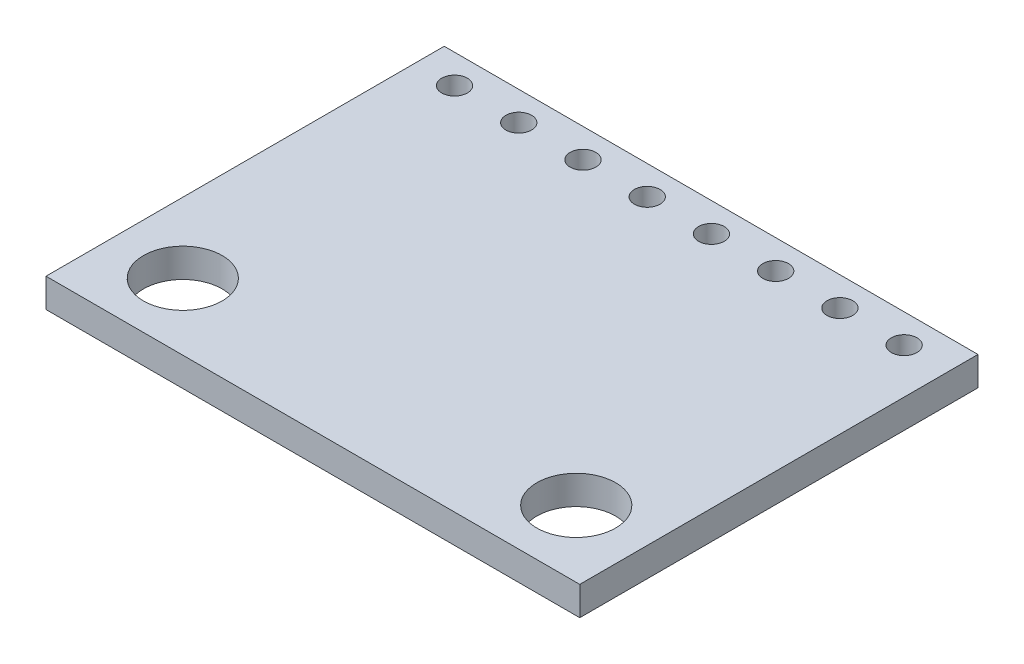
ISO-10303-21;
HEADER;
FILE_DESCRIPTION(('STEP AP214'),'2;1');
FILE_NAME('part.step','',(''),(''),'','','');
FILE_SCHEMA(('AUTOMOTIVE_DESIGN { 1 0 10303 214 1 1 1 1 }'));
ENDSEC;
DATA;
#1=APPLICATION_CONTEXT('core data for automotive mechanical design processes');
#2=APPLICATION_PROTOCOL_DEFINITION('international standard','automotive_design',2000,#1);
#3=PRODUCT_CONTEXT('',#1,'mechanical');
#4=PRODUCT('Part','Part','',(#3));
#5=PRODUCT_RELATED_PRODUCT_CATEGORY('part','',(#4));
#6=PRODUCT_DEFINITION_FORMATION('','',#4);
#7=PRODUCT_DEFINITION_CONTEXT('part definition',#1,'design');
#8=PRODUCT_DEFINITION('design','',#6,#7);
#9=PRODUCT_DEFINITION_SHAPE('','',#8);
#10=(LENGTH_UNIT() NAMED_UNIT(*) SI_UNIT(.MILLI.,.METRE.));
#11=(NAMED_UNIT(*) PLANE_ANGLE_UNIT() SI_UNIT($,.RADIAN.));
#12=(NAMED_UNIT(*) SI_UNIT($,.STERADIAN.) SOLID_ANGLE_UNIT());
#13=UNCERTAINTY_MEASURE_WITH_UNIT(LENGTH_MEASURE(1.E-05),#10,'distance_accuracy_value','');
#14=(GEOMETRIC_REPRESENTATION_CONTEXT(3) GLOBAL_UNCERTAINTY_ASSIGNED_CONTEXT((#13)) GLOBAL_UNIT_ASSIGNED_CONTEXT((#10,
#11,#12)) REPRESENTATION_CONTEXT('',''));
#15=CARTESIAN_POINT('',(0.,0.,0.));
#16=DIRECTION('',(0.,0.,1.));
#17=DIRECTION('',(1.,0.,0.));
#18=AXIS2_PLACEMENT_3D('',#15,#16,#17);
#19=CARTESIAN_POINT('',(0.,0.5715,0.));
#20=DIRECTION('',(0.,-1.,0.));
#21=DIRECTION('',(0.,0.,-1.));
#22=AXIS2_PLACEMENT_3D('',#19,#20,#21);
#23=PLANE('',#22);
#24=CARTESIAN_POINT('',(6.2357,0.5715,-6.731));
#25=DIRECTION('',(0.,1.,0.));
#26=DIRECTION('',(0.,0.,1.));
#27=AXIS2_PLACEMENT_3D('',#24,#25,#26);
#28=CIRCLE('',#27,0.508);
#29=CARTESIAN_POINT('',(6.2357,0.5715,-6.223));
#30=VERTEX_POINT('',#29);
#31=EDGE_CURVE('E159',#30,#30,#28,.T.);
#32=ORIENTED_EDGE('',*,*,#31,.F.);
#33=EDGE_LOOP('',(#32));
#34=FACE_BOUND('',#33,.T.);
#35=CARTESIAN_POINT('',(1.1557,0.5715,-6.731));
#36=DIRECTION('',(0.,1.,0.));
#37=DIRECTION('',(0.,0.,1.));
#38=AXIS2_PLACEMENT_3D('',#35,#36,#37);
#39=CIRCLE('',#38,0.508);
#40=CARTESIAN_POINT('',(1.1557,0.5715,-6.223));
#41=VERTEX_POINT('',#40);
#42=EDGE_CURVE('E147',#41,#41,#39,.T.);
#43=ORIENTED_EDGE('',*,*,#42,.F.);
#44=EDGE_LOOP('',(#43));
#45=FACE_BOUND('',#44,.T.);
#46=CARTESIAN_POINT('',(-3.9243,0.5715,-6.731));
#47=DIRECTION('',(0.,1.,0.));
#48=DIRECTION('',(0.,0.,1.));
#49=AXIS2_PLACEMENT_3D('',#46,#47,#48);
#50=CIRCLE('',#49,0.508);
#51=CARTESIAN_POINT('',(-3.9243,0.5715,-6.223));
#52=VERTEX_POINT('',#51);
#53=EDGE_CURVE('E135',#52,#52,#50,.T.);
#54=ORIENTED_EDGE('',*,*,#53,.F.);
#55=EDGE_LOOP('',(#54));
#56=FACE_BOUND('',#55,.T.);
#57=CARTESIAN_POINT('',(-9.0043,0.5715,-6.731));
#58=DIRECTION('',(0.,1.,0.));
#59=DIRECTION('',(0.,0.,1.));
#60=AXIS2_PLACEMENT_3D('',#57,#58,#59);
#61=CIRCLE('',#60,0.508);
#62=CARTESIAN_POINT('',(-9.0043,0.5715,-6.223));
#63=VERTEX_POINT('',#62);
#64=EDGE_CURVE('E123',#63,#63,#61,.T.);
#65=ORIENTED_EDGE('',*,*,#64,.F.);
#66=EDGE_LOOP('',(#65));
#67=FACE_BOUND('',#66,.T.);
#68=CARTESIAN_POINT('',(-7.77875,0.5715,5.23875));
#69=DIRECTION('',(0.,1.,0.));
#70=DIRECTION('',(0.,0.,1.));
#71=AXIS2_PLACEMENT_3D('',#68,#69,#70);
#72=CIRCLE('',#71,1.55575);
#73=CARTESIAN_POINT('',(-7.77875,0.5715,6.79449999999999));
#74=VERTEX_POINT('',#73);
#75=EDGE_CURVE('E102',#74,#74,#72,.T.);
#76=ORIENTED_EDGE('',*,*,#75,.F.);
#77=EDGE_LOOP('',(#76));
#78=FACE_BOUND('',#77,.T.);
#79=DIRECTION('',(0.,0.,-1.));
#80=VECTOR('',#79,1.);
#81=CARTESIAN_POINT('',(10.5537,0.5715,7.874));
#82=LINE('',#81,#80);
#83=CARTESIAN_POINT('',(10.5537,0.5715,7.874));
#84=VERTEX_POINT('',#83);
#85=CARTESIAN_POINT('',(10.5537,0.5715,-7.874));
#86=VERTEX_POINT('',#85);
#87=EDGE_CURVE('E87',#84,#86,#82,.T.);
#88=ORIENTED_EDGE('',*,*,#87,.T.);
#89=DIRECTION('',(-1.,0.,0.));
#90=VECTOR('',#89,1.);
#91=CARTESIAN_POINT('',(-10.5537,0.5715,-7.874));
#92=LINE('',#91,#90);
#93=CARTESIAN_POINT('',(-10.5537,0.5715,-7.874));
#94=VERTEX_POINT('',#93);
#95=EDGE_CURVE('E82',#86,#94,#92,.T.);
#96=ORIENTED_EDGE('',*,*,#95,.T.);
#97=DIRECTION('',(0.,0.,1.));
#98=VECTOR('',#97,1.);
#99=CARTESIAN_POINT('',(-10.5537,0.5715,7.874));
#100=LINE('',#99,#98);
#101=CARTESIAN_POINT('',(-10.5537,0.5715,7.874));
#102=VERTEX_POINT('',#101);
#103=EDGE_CURVE('E85',#94,#102,#100,.T.);
#104=ORIENTED_EDGE('',*,*,#103,.T.);
#105=DIRECTION('',(1.,0.,0.));
#106=VECTOR('',#105,1.);
#107=CARTESIAN_POINT('',(-10.5537,0.5715,7.874));
#108=LINE('',#107,#106);
#109=EDGE_CURVE('E52',#102,#84,#108,.T.);
#110=ORIENTED_EDGE('',*,*,#109,.T.);
#111=EDGE_LOOP('',(#88,#96,#104,#110));
#112=FACE_BOUND('',#111,.T.);
#113=CARTESIAN_POINT('',(7.77875,0.5715,5.23875));
#114=DIRECTION('',(0.,1.,0.));
#115=DIRECTION('',(0.,0.,-1.));
#116=AXIS2_PLACEMENT_3D('',#113,#114,#115);
#117=CIRCLE('',#116,1.55575);
#118=CARTESIAN_POINT('',(7.77875,0.5715,3.683));
#119=VERTEX_POINT('',#118);
#120=EDGE_CURVE('E117',#119,#119,#117,.T.);
#121=ORIENTED_EDGE('',*,*,#120,.F.);
#122=EDGE_LOOP('',(#121));
#123=FACE_BOUND('',#122,.T.);
#124=CARTESIAN_POINT('',(-6.4643,0.5715,-6.731));
#125=DIRECTION('',(0.,1.,0.));
#126=DIRECTION('',(0.,0.,1.));
#127=AXIS2_PLACEMENT_3D('',#124,#125,#126);
#128=CIRCLE('',#127,0.508);
#129=CARTESIAN_POINT('',(-6.4643,0.5715,-6.223));
#130=VERTEX_POINT('',#129);
#131=EDGE_CURVE('E129',#130,#130,#128,.T.);
#132=ORIENTED_EDGE('',*,*,#131,.F.);
#133=EDGE_LOOP('',(#132));
#134=FACE_BOUND('',#133,.T.);
#135=CARTESIAN_POINT('',(-1.3843,0.5715,-6.731));
#136=DIRECTION('',(0.,1.,0.));
#137=DIRECTION('',(0.,0.,1.));
#138=AXIS2_PLACEMENT_3D('',#135,#136,#137);
#139=CIRCLE('',#138,0.508);
#140=CARTESIAN_POINT('',(-1.3843,0.5715,-6.223));
#141=VERTEX_POINT('',#140);
#142=EDGE_CURVE('E141',#141,#141,#139,.T.);
#143=ORIENTED_EDGE('',*,*,#142,.F.);
#144=EDGE_LOOP('',(#143));
#145=FACE_BOUND('',#144,.T.);
#146=CARTESIAN_POINT('',(3.6957,0.5715,-6.731));
#147=DIRECTION('',(0.,1.,0.));
#148=DIRECTION('',(0.,0.,1.));
#149=AXIS2_PLACEMENT_3D('',#146,#147,#148);
#150=CIRCLE('',#149,0.508);
#151=CARTESIAN_POINT('',(3.6957,0.5715,-6.223));
#152=VERTEX_POINT('',#151);
#153=EDGE_CURVE('E153',#152,#152,#150,.T.);
#154=ORIENTED_EDGE('',*,*,#153,.F.);
#155=EDGE_LOOP('',(#154));
#156=FACE_BOUND('',#155,.T.);
#157=CARTESIAN_POINT('',(8.7757,0.5715,-6.731));
#158=DIRECTION('',(0.,1.,0.));
#159=DIRECTION('',(0.,0.,1.));
#160=AXIS2_PLACEMENT_3D('',#157,#158,#159);
#161=CIRCLE('',#160,0.508);
#162=CARTESIAN_POINT('',(8.7757,0.5715,-6.223));
#163=VERTEX_POINT('',#162);
#164=EDGE_CURVE('E165',#163,#163,#161,.T.);
#165=ORIENTED_EDGE('',*,*,#164,.F.);
#166=EDGE_LOOP('',(#165));
#167=FACE_BOUND('',#166,.T.);
#168=ADVANCED_FACE('F35',(#34,#45,#56,#67,#78,#112,#123,#134,#145,#156,#167),#23,.F.);
#169=CARTESIAN_POINT('',(0.,-0.5715,0.));
#170=DIRECTION('',(0.,-1.,0.));
#171=DIRECTION('',(0.,0.,-1.));
#172=AXIS2_PLACEMENT_3D('',#169,#170,#171);
#173=PLANE('',#172);
#174=CARTESIAN_POINT('',(6.2357,-0.5715,-6.731));
#175=DIRECTION('',(0.,1.,0.));
#176=DIRECTION('',(0.,0.,1.));
#177=AXIS2_PLACEMENT_3D('',#174,#175,#176);
#178=CIRCLE('',#177,0.508);
#179=CARTESIAN_POINT('',(6.2357,-0.5715,-6.223));
#180=VERTEX_POINT('',#179);
#181=EDGE_CURVE('E162',#180,#180,#178,.T.);
#182=ORIENTED_EDGE('',*,*,#181,.T.);
#183=EDGE_LOOP('',(#182));
#184=FACE_BOUND('',#183,.T.);
#185=CARTESIAN_POINT('',(1.1557,-0.5715,-6.731));
#186=DIRECTION('',(0.,1.,0.));
#187=DIRECTION('',(0.,0.,1.));
#188=AXIS2_PLACEMENT_3D('',#185,#186,#187);
#189=CIRCLE('',#188,0.508);
#190=CARTESIAN_POINT('',(1.1557,-0.5715,-6.223));
#191=VERTEX_POINT('',#190);
#192=EDGE_CURVE('E150',#191,#191,#189,.T.);
#193=ORIENTED_EDGE('',*,*,#192,.T.);
#194=EDGE_LOOP('',(#193));
#195=FACE_BOUND('',#194,.T.);
#196=CARTESIAN_POINT('',(-3.9243,-0.5715,-6.731));
#197=DIRECTION('',(0.,1.,0.));
#198=DIRECTION('',(0.,0.,1.));
#199=AXIS2_PLACEMENT_3D('',#196,#197,#198);
#200=CIRCLE('',#199,0.508);
#201=CARTESIAN_POINT('',(-3.9243,-0.5715,-6.223));
#202=VERTEX_POINT('',#201);
#203=EDGE_CURVE('E138',#202,#202,#200,.T.);
#204=ORIENTED_EDGE('',*,*,#203,.T.);
#205=EDGE_LOOP('',(#204));
#206=FACE_BOUND('',#205,.T.);
#207=CARTESIAN_POINT('',(-9.0043,-0.5715,-6.731));
#208=DIRECTION('',(0.,1.,0.));
#209=DIRECTION('',(0.,0.,1.));
#210=AXIS2_PLACEMENT_3D('',#207,#208,#209);
#211=CIRCLE('',#210,0.508);
#212=CARTESIAN_POINT('',(-9.0043,-0.5715,-6.223));
#213=VERTEX_POINT('',#212);
#214=EDGE_CURVE('E126',#213,#213,#211,.T.);
#215=ORIENTED_EDGE('',*,*,#214,.T.);
#216=EDGE_LOOP('',(#215));
#217=FACE_BOUND('',#216,.T.);
#218=CARTESIAN_POINT('',(-7.77875,-0.5715,5.23875));
#219=DIRECTION('',(0.,1.,0.));
#220=DIRECTION('',(0.,0.,1.));
#221=AXIS2_PLACEMENT_3D('',#218,#219,#220);
#222=CIRCLE('',#221,1.55575);
#223=CARTESIAN_POINT('',(-7.77875,-0.5715,6.79449999999999));
#224=VERTEX_POINT('',#223);
#225=EDGE_CURVE('E114',#224,#224,#222,.T.);
#226=ORIENTED_EDGE('',*,*,#225,.T.);
#227=EDGE_LOOP('',(#226));
#228=FACE_BOUND('',#227,.T.);
#229=DIRECTION('',(0.,0.,-1.));
#230=VECTOR('',#229,1.);
#231=CARTESIAN_POINT('',(10.5537,-0.5715,7.874));
#232=LINE('',#231,#230);
#233=CARTESIAN_POINT('',(10.5537,-0.5715,7.874));
#234=VERTEX_POINT('',#233);
#235=CARTESIAN_POINT('',(10.5537,-0.5715,-7.874));
#236=VERTEX_POINT('',#235);
#237=EDGE_CURVE('E99',#234,#236,#232,.T.);
#238=ORIENTED_EDGE('',*,*,#237,.F.);
#239=DIRECTION('',(1.,0.,0.));
#240=VECTOR('',#239,1.);
#241=CARTESIAN_POINT('',(-10.5537,-0.5715,7.874));
#242=LINE('',#241,#240);
#243=CARTESIAN_POINT('',(-10.5537,-0.5715,7.874));
#244=VERTEX_POINT('',#243);
#245=EDGE_CURVE('E75',#244,#234,#242,.T.);
#246=ORIENTED_EDGE('',*,*,#245,.F.);
#247=DIRECTION('',(0.,0.,1.));
#248=VECTOR('',#247,1.);
#249=CARTESIAN_POINT('',(-10.5537,-0.5715,7.874));
#250=LINE('',#249,#248);
#251=CARTESIAN_POINT('',(-10.5537,-0.5715,-7.874));
#252=VERTEX_POINT('',#251);
#253=EDGE_CURVE('E69',#252,#244,#250,.T.);
#254=ORIENTED_EDGE('',*,*,#253,.F.);
#255=DIRECTION('',(-1.,0.,0.));
#256=VECTOR('',#255,1.);
#257=CARTESIAN_POINT('',(-10.5537,-0.5715,-7.874));
#258=LINE('',#257,#256);
#259=EDGE_CURVE('E91',#236,#252,#258,.T.);
#260=ORIENTED_EDGE('',*,*,#259,.F.);
#261=EDGE_LOOP('',(#238,#246,#254,#260));
#262=FACE_BOUND('',#261,.T.);
#263=CARTESIAN_POINT('',(7.77875,-0.5715,5.23875));
#264=DIRECTION('',(0.,1.,0.));
#265=DIRECTION('',(0.,0.,-1.));
#266=AXIS2_PLACEMENT_3D('',#263,#264,#265);
#267=CIRCLE('',#266,1.55575);
#268=CARTESIAN_POINT('',(7.77875,-0.5715,3.683));
#269=VERTEX_POINT('',#268);
#270=EDGE_CURVE('E120',#269,#269,#267,.T.);
#271=ORIENTED_EDGE('',*,*,#270,.T.);
#272=EDGE_LOOP('',(#271));
#273=FACE_BOUND('',#272,.T.);
#274=CARTESIAN_POINT('',(-6.4643,-0.5715,-6.731));
#275=DIRECTION('',(0.,1.,0.));
#276=DIRECTION('',(0.,0.,1.));
#277=AXIS2_PLACEMENT_3D('',#274,#275,#276);
#278=CIRCLE('',#277,0.508);
#279=CARTESIAN_POINT('',(-6.4643,-0.5715,-6.223));
#280=VERTEX_POINT('',#279);
#281=EDGE_CURVE('E132',#280,#280,#278,.T.);
#282=ORIENTED_EDGE('',*,*,#281,.T.);
#283=EDGE_LOOP('',(#282));
#284=FACE_BOUND('',#283,.T.);
#285=CARTESIAN_POINT('',(-1.3843,-0.5715,-6.731));
#286=DIRECTION('',(0.,1.,0.));
#287=DIRECTION('',(0.,0.,1.));
#288=AXIS2_PLACEMENT_3D('',#285,#286,#287);
#289=CIRCLE('',#288,0.508);
#290=CARTESIAN_POINT('',(-1.3843,-0.5715,-6.223));
#291=VERTEX_POINT('',#290);
#292=EDGE_CURVE('E144',#291,#291,#289,.T.);
#293=ORIENTED_EDGE('',*,*,#292,.T.);
#294=EDGE_LOOP('',(#293));
#295=FACE_BOUND('',#294,.T.);
#296=CARTESIAN_POINT('',(3.6957,-0.5715,-6.731));
#297=DIRECTION('',(0.,1.,0.));
#298=DIRECTION('',(0.,0.,1.));
#299=AXIS2_PLACEMENT_3D('',#296,#297,#298);
#300=CIRCLE('',#299,0.508);
#301=CARTESIAN_POINT('',(3.6957,-0.5715,-6.223));
#302=VERTEX_POINT('',#301);
#303=EDGE_CURVE('E156',#302,#302,#300,.T.);
#304=ORIENTED_EDGE('',*,*,#303,.T.);
#305=EDGE_LOOP('',(#304));
#306=FACE_BOUND('',#305,.T.);
#307=CARTESIAN_POINT('',(8.7757,-0.5715,-6.731));
#308=DIRECTION('',(0.,1.,0.));
#309=DIRECTION('',(0.,0.,1.));
#310=AXIS2_PLACEMENT_3D('',#307,#308,#309);
#311=CIRCLE('',#310,0.508);
#312=CARTESIAN_POINT('',(8.7757,-0.5715,-6.223));
#313=VERTEX_POINT('',#312);
#314=EDGE_CURVE('E168',#313,#313,#311,.T.);
#315=ORIENTED_EDGE('',*,*,#314,.T.);
#316=EDGE_LOOP('',(#315));
#317=FACE_BOUND('',#316,.T.);
#318=ADVANCED_FACE('F110',(#184,#195,#206,#217,#228,#262,#273,#284,#295,#306,#317),#173,.T.);
#319=CARTESIAN_POINT('',(10.5537,0.5715,7.874));
#320=DIRECTION('',(-1.,0.,0.));
#321=DIRECTION('',(0.,0.,1.));
#322=AXIS2_PLACEMENT_3D('',#319,#320,#321);
#323=PLANE('',#322);
#324=ORIENTED_EDGE('',*,*,#237,.T.);
#325=DIRECTION('',(0.,-1.,0.));
#326=VECTOR('',#325,1.);
#327=CARTESIAN_POINT('',(10.5537,0.5715,-7.874));
#328=LINE('',#327,#326);
#329=EDGE_CURVE('E11',#86,#236,#328,.T.);
#330=ORIENTED_EDGE('',*,*,#329,.F.);
#331=ORIENTED_EDGE('',*,*,#87,.F.);
#332=DIRECTION('',(0.,-1.,0.));
#333=VECTOR('',#332,1.);
#334=CARTESIAN_POINT('',(10.5537,0.5715,7.874));
#335=LINE('',#334,#333);
#336=EDGE_CURVE('E95',#84,#234,#335,.T.);
#337=ORIENTED_EDGE('',*,*,#336,.T.);
#338=EDGE_LOOP('',(#324,#330,#331,#337));
#339=FACE_BOUND('',#338,.T.);
#340=ADVANCED_FACE('F37',(#339),#323,.F.);
#341=CARTESIAN_POINT('',(-10.5537,0.5715,-7.874));
#342=DIRECTION('',(0.,0.,1.));
#343=DIRECTION('',(1.,0.,0.));
#344=AXIS2_PLACEMENT_3D('',#341,#342,#343);
#345=PLANE('',#344);
#346=ORIENTED_EDGE('',*,*,#259,.T.);
#347=DIRECTION('',(0.,-1.,0.));
#348=VECTOR('',#347,1.);
#349=CARTESIAN_POINT('',(-10.5537,0.5715,-7.874));
#350=LINE('',#349,#348);
#351=EDGE_CURVE('E44',#94,#252,#350,.T.);
#352=ORIENTED_EDGE('',*,*,#351,.F.);
#353=ORIENTED_EDGE('',*,*,#95,.F.);
#354=ORIENTED_EDGE('',*,*,#329,.T.);
#355=EDGE_LOOP('',(#346,#352,#353,#354));
#356=FACE_BOUND('',#355,.T.);
#357=ADVANCED_FACE('F90',(#356),#345,.F.);
#358=CARTESIAN_POINT('',(-10.5537,0.5715,7.874));
#359=DIRECTION('',(1.,0.,0.));
#360=DIRECTION('',(0.,0.,-1.));
#361=AXIS2_PLACEMENT_3D('',#358,#359,#360);
#362=PLANE('',#361);
#363=ORIENTED_EDGE('',*,*,#253,.T.);
#364=DIRECTION('',(0.,-1.,0.));
#365=VECTOR('',#364,1.);
#366=CARTESIAN_POINT('',(-10.5537,0.5715,7.874));
#367=LINE('',#366,#365);
#368=EDGE_CURVE('E92',#102,#244,#367,.T.);
#369=ORIENTED_EDGE('',*,*,#368,.F.);
#370=ORIENTED_EDGE('',*,*,#103,.F.);
#371=ORIENTED_EDGE('',*,*,#351,.T.);
#372=EDGE_LOOP('',(#363,#369,#370,#371));
#373=FACE_BOUND('',#372,.T.);
#374=ADVANCED_FACE('F93',(#373),#362,.F.);
#375=CARTESIAN_POINT('',(-10.5537,0.5715,7.874));
#376=DIRECTION('',(0.,0.,-1.));
#377=DIRECTION('',(-1.,0.,0.));
#378=AXIS2_PLACEMENT_3D('',#375,#376,#377);
#379=PLANE('',#378);
#380=ORIENTED_EDGE('',*,*,#245,.T.);
#381=ORIENTED_EDGE('',*,*,#336,.F.);
#382=ORIENTED_EDGE('',*,*,#109,.F.);
#383=ORIENTED_EDGE('',*,*,#368,.T.);
#384=EDGE_LOOP('',(#380,#381,#382,#383));
#385=FACE_BOUND('',#384,.T.);
#386=ADVANCED_FACE('F107',(#385),#379,.F.);
#387=CARTESIAN_POINT('',(-7.77875,0.5715,5.23875));
#388=DIRECTION('',(0.,-1.,0.));
#389=DIRECTION('',(0.,0.,-1.));
#390=AXIS2_PLACEMENT_3D('',#387,#388,#389);
#391=CYLINDRICAL_SURFACE('',#390,1.55575);
#392=ORIENTED_EDGE('',*,*,#75,.T.);
#393=EDGE_LOOP('',(#392));
#394=FACE_BOUND('',#393,.T.);
#395=ORIENTED_EDGE('',*,*,#225,.F.);
#396=EDGE_LOOP('',(#395));
#397=FACE_BOUND('',#396,.T.);
#398=ADVANCED_FACE('F188',(#394,#397),#391,.F.);
#399=CARTESIAN_POINT('',(7.77875,0.5715,5.23875));
#400=DIRECTION('',(0.,-1.,0.));
#401=DIRECTION('',(0.,0.,-1.));
#402=AXIS2_PLACEMENT_3D('',#399,#400,#401);
#403=CYLINDRICAL_SURFACE('',#402,1.55575);
#404=ORIENTED_EDGE('',*,*,#120,.T.);
#405=EDGE_LOOP('',(#404));
#406=FACE_BOUND('',#405,.T.);
#407=ORIENTED_EDGE('',*,*,#270,.F.);
#408=EDGE_LOOP('',(#407));
#409=FACE_BOUND('',#408,.T.);
#410=ADVANCED_FACE('F212',(#406,#409),#403,.F.);
#411=CARTESIAN_POINT('',(-9.0043,0.5715,-6.731));
#412=DIRECTION('',(0.,-1.,0.));
#413=DIRECTION('',(0.,0.,-1.));
#414=AXIS2_PLACEMENT_3D('',#411,#412,#413);
#415=CYLINDRICAL_SURFACE('',#414,0.508);
#416=ORIENTED_EDGE('',*,*,#64,.T.);
#417=EDGE_LOOP('',(#416));
#418=FACE_BOUND('',#417,.T.);
#419=ORIENTED_EDGE('',*,*,#214,.F.);
#420=EDGE_LOOP('',(#419));
#421=FACE_BOUND('',#420,.T.);
#422=ADVANCED_FACE('F217',(#418,#421),#415,.F.);
#423=CARTESIAN_POINT('',(-6.4643,0.5715,-6.731));
#424=DIRECTION('',(0.,-1.,0.));
#425=DIRECTION('',(0.,0.,-1.));
#426=AXIS2_PLACEMENT_3D('',#423,#424,#425);
#427=CYLINDRICAL_SURFACE('',#426,0.508);
#428=ORIENTED_EDGE('',*,*,#131,.T.);
#429=EDGE_LOOP('',(#428));
#430=FACE_BOUND('',#429,.T.);
#431=ORIENTED_EDGE('',*,*,#281,.F.);
#432=EDGE_LOOP('',(#431));
#433=FACE_BOUND('',#432,.T.);
#434=ADVANCED_FACE('F235',(#430,#433),#427,.F.);
#435=CARTESIAN_POINT('',(-3.9243,0.5715,-6.731));
#436=DIRECTION('',(0.,-1.,0.));
#437=DIRECTION('',(0.,0.,-1.));
#438=AXIS2_PLACEMENT_3D('',#435,#436,#437);
#439=CYLINDRICAL_SURFACE('',#438,0.508);
#440=ORIENTED_EDGE('',*,*,#53,.T.);
#441=EDGE_LOOP('',(#440));
#442=FACE_BOUND('',#441,.T.);
#443=ORIENTED_EDGE('',*,*,#203,.F.);
#444=EDGE_LOOP('',(#443));
#445=FACE_BOUND('',#444,.T.);
#446=ADVANCED_FACE('F245',(#442,#445),#439,.F.);
#447=CARTESIAN_POINT('',(-1.3843,0.5715,-6.731));
#448=DIRECTION('',(0.,-1.,0.));
#449=DIRECTION('',(0.,0.,-1.));
#450=AXIS2_PLACEMENT_3D('',#447,#448,#449);
#451=CYLINDRICAL_SURFACE('',#450,0.508);
#452=ORIENTED_EDGE('',*,*,#142,.T.);
#453=EDGE_LOOP('',(#452));
#454=FACE_BOUND('',#453,.T.);
#455=ORIENTED_EDGE('',*,*,#292,.F.);
#456=EDGE_LOOP('',(#455));
#457=FACE_BOUND('',#456,.T.);
#458=ADVANCED_FACE('F255',(#454,#457),#451,.F.);
#459=CARTESIAN_POINT('',(1.1557,0.5715,-6.731));
#460=DIRECTION('',(0.,-1.,0.));
#461=DIRECTION('',(0.,0.,-1.));
#462=AXIS2_PLACEMENT_3D('',#459,#460,#461);
#463=CYLINDRICAL_SURFACE('',#462,0.508);
#464=ORIENTED_EDGE('',*,*,#42,.T.);
#465=EDGE_LOOP('',(#464));
#466=FACE_BOUND('',#465,.T.);
#467=ORIENTED_EDGE('',*,*,#192,.F.);
#468=EDGE_LOOP('',(#467));
#469=FACE_BOUND('',#468,.T.);
#470=ADVANCED_FACE('F265',(#466,#469),#463,.F.);
#471=CARTESIAN_POINT('',(3.6957,0.5715,-6.731));
#472=DIRECTION('',(0.,-1.,0.));
#473=DIRECTION('',(0.,0.,-1.));
#474=AXIS2_PLACEMENT_3D('',#471,#472,#473);
#475=CYLINDRICAL_SURFACE('',#474,0.508);
#476=ORIENTED_EDGE('',*,*,#153,.T.);
#477=EDGE_LOOP('',(#476));
#478=FACE_BOUND('',#477,.T.);
#479=ORIENTED_EDGE('',*,*,#303,.F.);
#480=EDGE_LOOP('',(#479));
#481=FACE_BOUND('',#480,.T.);
#482=ADVANCED_FACE('F275',(#478,#481),#475,.F.);
#483=CARTESIAN_POINT('',(6.2357,0.5715,-6.731));
#484=DIRECTION('',(0.,-1.,0.));
#485=DIRECTION('',(0.,0.,-1.));
#486=AXIS2_PLACEMENT_3D('',#483,#484,#485);
#487=CYLINDRICAL_SURFACE('',#486,0.508);
#488=ORIENTED_EDGE('',*,*,#31,.T.);
#489=EDGE_LOOP('',(#488));
#490=FACE_BOUND('',#489,.T.);
#491=ORIENTED_EDGE('',*,*,#181,.F.);
#492=EDGE_LOOP('',(#491));
#493=FACE_BOUND('',#492,.T.);
#494=ADVANCED_FACE('F285',(#490,#493),#487,.F.);
#495=CARTESIAN_POINT('',(8.7757,0.5715,-6.731));
#496=DIRECTION('',(0.,-1.,0.));
#497=DIRECTION('',(0.,0.,-1.));
#498=AXIS2_PLACEMENT_3D('',#495,#496,#497);
#499=CYLINDRICAL_SURFACE('',#498,0.508);
#500=ORIENTED_EDGE('',*,*,#164,.T.);
#501=EDGE_LOOP('',(#500));
#502=FACE_BOUND('',#501,.T.);
#503=ORIENTED_EDGE('',*,*,#314,.F.);
#504=EDGE_LOOP('',(#503));
#505=FACE_BOUND('',#504,.T.);
#506=ADVANCED_FACE('F174',(#502,#505),#499,.F.);
#507=CLOSED_SHELL('',(#168,#318,#340,#357,#374,#386,#398,#410,#422,#434,#446,#458,#470,#482,
#494,#506));
#508=MANIFOLD_SOLID_BREP('B2',#507);
#509=ADVANCED_BREP_SHAPE_REPRESENTATION('',(#18,#508),#14);
#510=SHAPE_DEFINITION_REPRESENTATION(#9,#509);
ENDSEC;
END-ISO-10303-21;
